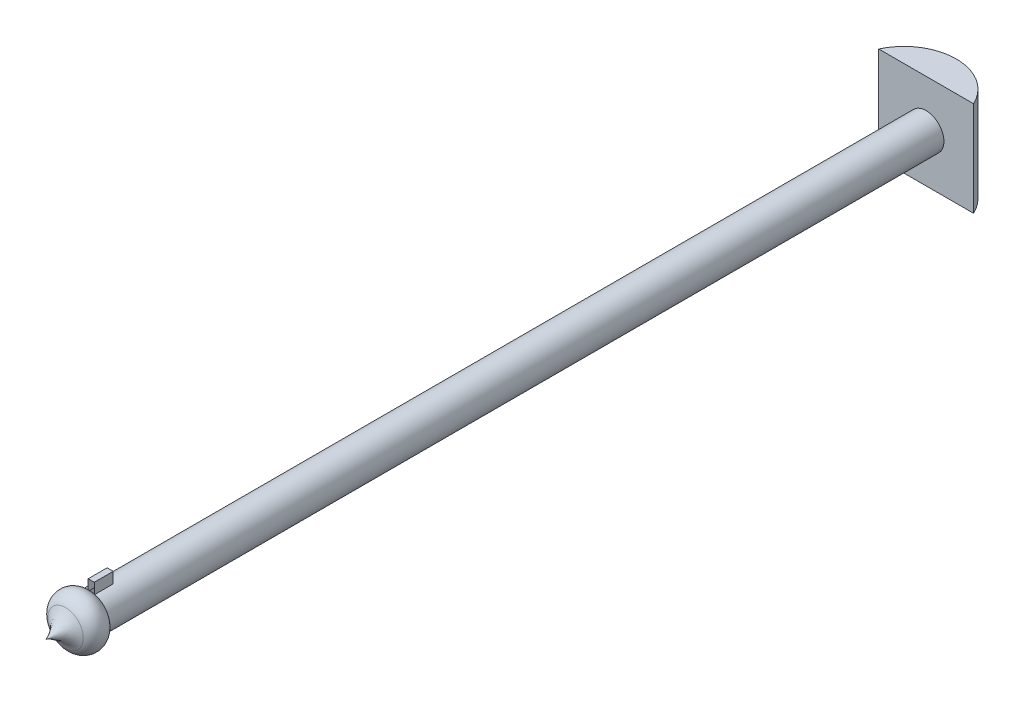
ISO-10303-21;
HEADER;
FILE_DESCRIPTION(('STEP AP214'),'2;1');
FILE_NAME('part.step','',(''),(''),'','','');
FILE_SCHEMA(('AUTOMOTIVE_DESIGN { 1 0 10303 214 1 1 1 1 }'));
ENDSEC;
DATA;
#1=APPLICATION_CONTEXT('core data for automotive mechanical design processes');
#2=APPLICATION_PROTOCOL_DEFINITION('international standard','automotive_design',2000,#1);
#3=PRODUCT_CONTEXT('',#1,'mechanical');
#4=PRODUCT('Part','Part','',(#3));
#5=PRODUCT_RELATED_PRODUCT_CATEGORY('part','',(#4));
#6=PRODUCT_DEFINITION_FORMATION('','',#4);
#7=PRODUCT_DEFINITION_CONTEXT('part definition',#1,'design');
#8=PRODUCT_DEFINITION('design','',#6,#7);
#9=PRODUCT_DEFINITION_SHAPE('','',#8);
#10=(LENGTH_UNIT() NAMED_UNIT(*) SI_UNIT(.MILLI.,.METRE.));
#11=(NAMED_UNIT(*) PLANE_ANGLE_UNIT() SI_UNIT($,.RADIAN.));
#12=(NAMED_UNIT(*) SI_UNIT($,.STERADIAN.) SOLID_ANGLE_UNIT());
#13=UNCERTAINTY_MEASURE_WITH_UNIT(LENGTH_MEASURE(1.E-05),#10,'distance_accuracy_value','');
#14=(GEOMETRIC_REPRESENTATION_CONTEXT(3) GLOBAL_UNCERTAINTY_ASSIGNED_CONTEXT((#13)) GLOBAL_UNIT_ASSIGNED_CONTEXT((#10,
#11,#12)) REPRESENTATION_CONTEXT('',''));
#15=CARTESIAN_POINT('',(0.,0.,0.));
#16=DIRECTION('',(0.,0.,1.));
#17=DIRECTION('',(1.,0.,0.));
#18=AXIS2_PLACEMENT_3D('',#15,#16,#17);
#19=CARTESIAN_POINT('',(0.,6.35,5.53777131074244));
#20=DIRECTION('',(0.,-1.,0.));
#21=DIRECTION('',(0.,0.,-1.));
#22=AXIS2_PLACEMENT_3D('',#19,#20,#21);
#23=CYLINDRICAL_SURFACE('',#22,7.0119607149684);
#24=CARTESIAN_POINT('',(0.,-6.35,5.53777131074244));
#25=DIRECTION('',(0.,1.,0.));
#26=DIRECTION('',(0.,0.,1.));
#27=AXIS2_PLACEMENT_3D('',#24,#25,#26);
#28=CIRCLE('',#27,7.0119607149684);
#29=CARTESIAN_POINT('',(-6.35,-6.35,2.56370119249368));
#30=VERTEX_POINT('',#29);
#31=CARTESIAN_POINT('',(6.35,-6.35,2.56370119249368));
#32=VERTEX_POINT('',#31);
#33=EDGE_CURVE('E147',#30,#32,#28,.F.);
#34=ORIENTED_EDGE('',*,*,#33,.F.);
#35=DIRECTION('',(0.,-1.,0.));
#36=VECTOR('',#35,1.);
#37=CARTESIAN_POINT('',(-6.35,6.35,2.56370119249368));
#38=LINE('',#37,#36);
#39=CARTESIAN_POINT('',(-6.35,6.35,2.56370119249368));
#40=VERTEX_POINT('',#39);
#41=EDGE_CURVE('E166',#40,#30,#38,.T.);
#42=ORIENTED_EDGE('',*,*,#41,.F.);
#43=CARTESIAN_POINT('',(0.,6.35,5.53777131074244));
#44=DIRECTION('',(0.,1.,0.));
#45=DIRECTION('',(0.,0.,1.));
#46=AXIS2_PLACEMENT_3D('',#43,#44,#45);
#47=CIRCLE('',#46,7.0119607149684);
#48=CARTESIAN_POINT('',(6.35,6.35,2.56370119249368));
#49=VERTEX_POINT('',#48);
#50=EDGE_CURVE('E148',#40,#49,#47,.F.);
#51=ORIENTED_EDGE('',*,*,#50,.T.);
#52=DIRECTION('',(0.,-1.,0.));
#53=VECTOR('',#52,1.);
#54=CARTESIAN_POINT('',(6.35,6.35,2.56370119249368));
#55=LINE('',#54,#53);
#56=EDGE_CURVE('E157',#49,#32,#55,.T.);
#57=ORIENTED_EDGE('',*,*,#56,.T.);
#58=EDGE_LOOP('',(#34,#42,#51,#57));
#59=FACE_BOUND('',#58,.T.);
#60=ADVANCED_FACE('F41',(#59),#23,.T.);
#61=CARTESIAN_POINT('',(0.,6.35,2.56370119249368));
#62=DIRECTION('',(0.,0.,1.));
#63=DIRECTION('',(1.,0.,0.));
#64=AXIS2_PLACEMENT_3D('',#61,#62,#63);
#65=PLANE('',#64);
#66=CARTESIAN_POINT('',(0.,0.,2.56370119249368));
#67=DIRECTION('',(0.,0.,1.));
#68=DIRECTION('',(1.,0.,0.));
#69=AXIS2_PLACEMENT_3D('',#66,#67,#68);
#70=CIRCLE('',#69,2.38125);
#71=CARTESIAN_POINT('',(2.38125,0.,2.56370119249368));
#72=VERTEX_POINT('',#71);
#73=EDGE_CURVE('E169',#72,#72,#70,.T.);
#74=ORIENTED_EDGE('',*,*,#73,.F.);
#75=EDGE_LOOP('',(#74));
#76=FACE_BOUND('',#75,.T.);
#77=DIRECTION('',(-1.,0.,0.));
#78=VECTOR('',#77,1.);
#79=CARTESIAN_POINT('',(0.,-6.35,2.56370119249368));
#80=LINE('',#79,#78);
#81=EDGE_CURVE('E153',#32,#30,#80,.T.);
#82=ORIENTED_EDGE('',*,*,#81,.F.);
#83=ORIENTED_EDGE('',*,*,#56,.F.);
#84=DIRECTION('',(-1.,0.,0.));
#85=VECTOR('',#84,1.);
#86=CARTESIAN_POINT('',(0.,6.35,2.56370119249368));
#87=LINE('',#86,#85);
#88=EDGE_CURVE('E152',#49,#40,#87,.T.);
#89=ORIENTED_EDGE('',*,*,#88,.T.);
#90=ORIENTED_EDGE('',*,*,#41,.T.);
#91=EDGE_LOOP('',(#82,#83,#89,#90));
#92=FACE_BOUND('',#91,.T.);
#93=ADVANCED_FACE('F206',(#76,#92),#65,.T.);
#94=CARTESIAN_POINT('',(0.,6.35,0.));
#95=DIRECTION('',(0.,1.,0.));
#96=DIRECTION('',(0.,0.,1.));
#97=AXIS2_PLACEMENT_3D('',#94,#95,#96);
#98=PLANE('',#97);
#99=ORIENTED_EDGE('',*,*,#50,.F.);
#100=ORIENTED_EDGE('',*,*,#88,.F.);
#101=EDGE_LOOP('',(#99,#100));
#102=FACE_BOUND('',#101,.T.);
#103=ADVANCED_FACE('F212',(#102),#98,.T.);
#104=CARTESIAN_POINT('',(0.,-6.35,0.));
#105=DIRECTION('',(0.,1.,0.));
#106=DIRECTION('',(0.,0.,1.));
#107=AXIS2_PLACEMENT_3D('',#104,#105,#106);
#108=PLANE('',#107);
#109=ORIENTED_EDGE('',*,*,#33,.T.);
#110=ORIENTED_EDGE('',*,*,#81,.T.);
#111=EDGE_LOOP('',(#109,#110));
#112=FACE_BOUND('',#111,.T.);
#113=ADVANCED_FACE('F223',(#112),#108,.F.);
#114=CARTESIAN_POINT('',(0.,0.,114.3));
#115=DIRECTION('',(0.,0.,-1.));
#116=DIRECTION('',(-1.,0.,0.));
#117=AXIS2_PLACEMENT_3D('',#114,#115,#116);
#118=CYLINDRICAL_SURFACE('',#117,2.38125);
#119=CARTESIAN_POINT('',(0.,0.,114.3));
#120=DIRECTION('',(0.,0.,1.));
#121=DIRECTION('',(1.,0.,0.));
#122=AXIS2_PLACEMENT_3D('',#119,#120,#121);
#123=CIRCLE('',#122,2.38125);
#124=CARTESIAN_POINT('',(-0.393640410863406,2.34848861811917,114.3));
#125=VERTEX_POINT('',#124);
#126=CARTESIAN_POINT('',(-2.38125,0.,114.3));
#127=VERTEX_POINT('',#126);
#128=EDGE_CURVE('E50',#125,#127,#123,.T.);
#129=ORIENTED_EDGE('',*,*,#128,.F.);
#130=DIRECTION('',(0.,0.,-1.));
#131=VECTOR('',#130,1.);
#132=CARTESIAN_POINT('',(-0.393640410863406,2.34848861811917,114.3));
#133=LINE('',#132,#131);
#134=CARTESIAN_POINT('',(-0.393640410863406,2.34848861811917,111.76));
#135=VERTEX_POINT('',#134);
#136=EDGE_CURVE('E143',#125,#135,#133,.T.);
#137=ORIENTED_EDGE('',*,*,#136,.T.);
#138=CARTESIAN_POINT('',(0.,0.,111.76));
#139=DIRECTION('',(0.,0.,1.));
#140=DIRECTION('',(1.,0.,0.));
#141=AXIS2_PLACEMENT_3D('',#138,#139,#140);
#142=CIRCLE('',#141,2.38125);
#143=CARTESIAN_POINT('',(0.42078802540571,2.34377665321915,111.76));
#144=VERTEX_POINT('',#143);
#145=EDGE_CURVE('E11',#144,#135,#142,.T.);
#146=ORIENTED_EDGE('',*,*,#145,.F.);
#147=DIRECTION('',(0.,0.,-1.));
#148=VECTOR('',#147,1.);
#149=CARTESIAN_POINT('',(0.420788025405711,2.34377665321915,114.3));
#150=LINE('',#149,#148);
#151=CARTESIAN_POINT('',(0.420788025405711,2.34377665321915,114.3));
#152=VERTEX_POINT('',#151);
#153=EDGE_CURVE('E136',#144,#152,#150,.F.);
#154=ORIENTED_EDGE('',*,*,#153,.T.);
#155=EDGE_CURVE('E171',#127,#152,#123,.T.);
#156=ORIENTED_EDGE('',*,*,#155,.F.);
#157=EDGE_LOOP('',(#129,#137,#146,#154,#156));
#158=FACE_BOUND('',#157,.T.);
#159=ORIENTED_EDGE('',*,*,#73,.T.);
#160=EDGE_LOOP('',(#159));
#161=FACE_BOUND('',#160,.T.);
#162=ADVANCED_FACE('F43',(#158,#161),#118,.T.);
#163=CARTESIAN_POINT('',(0.,0.,114.3));
#164=DIRECTION('',(0.,0.,1.));
#165=DIRECTION('',(1.,0.,0.));
#166=AXIS2_PLACEMENT_3D('',#163,#164,#165);
#167=PLANE('',#166);
#168=ORIENTED_EDGE('',*,*,#128,.T.);
#169=CARTESIAN_POINT('',(-2.13477296963881E-05,0.,114.3));
#170=DIRECTION('',(0.,0.,-1.));
#171=DIRECTION('',(-1.,0.,0.));
#172=AXIS2_PLACEMENT_3D('',#169,#170,#171);
#173=CIRCLE('',#172,2.3812286522703);
#174=EDGE_CURVE('E55',#127,#127,#173,.T.);
#175=ORIENTED_EDGE('',*,*,#174,.T.);
#176=ORIENTED_EDGE('',*,*,#155,.T.);
#177=DIRECTION('',(0.,1.,0.));
#178=VECTOR('',#177,1.);
#179=CARTESIAN_POINT('',(0.420788025405711,0.,114.3));
#180=LINE('',#179,#178);
#181=CARTESIAN_POINT('',(0.420788025405711,3.80066603592294,114.3));
#182=VERTEX_POINT('',#181);
#183=EDGE_CURVE('E109',#152,#182,#180,.T.);
#184=ORIENTED_EDGE('',*,*,#183,.T.);
#185=DIRECTION('',(-1.,0.,0.));
#186=VECTOR('',#185,1.);
#187=CARTESIAN_POINT('',(0.420788025405711,3.80066603592294,114.3));
#188=LINE('',#187,#186);
#189=CARTESIAN_POINT('',(-0.393640410863406,3.80066603592294,114.3));
#190=VERTEX_POINT('',#189);
#191=EDGE_CURVE('E113',#182,#190,#188,.T.);
#192=ORIENTED_EDGE('',*,*,#191,.T.);
#193=DIRECTION('',(0.,-1.,0.));
#194=VECTOR('',#193,1.);
#195=CARTESIAN_POINT('',(-0.393640410863406,3.80066603592294,114.3));
#196=LINE('',#195,#194);
#197=EDGE_CURVE('E62',#190,#125,#196,.T.);
#198=ORIENTED_EDGE('',*,*,#197,.T.);
#199=EDGE_LOOP('',(#168,#175,#176,#184,#192,#198));
#200=FACE_BOUND('',#199,.T.);
#201=ADVANCED_FACE('F179',(#200),#167,.T.);
#202=CARTESIAN_POINT('',(-0.393640410863406,3.80066603592294,111.76));
#203=DIRECTION('',(-1.,0.,0.));
#204=DIRECTION('',(0.,0.,1.));
#205=AXIS2_PLACEMENT_3D('',#202,#203,#204);
#206=PLANE('',#205);
#207=ORIENTED_EDGE('',*,*,#136,.F.);
#208=ORIENTED_EDGE('',*,*,#197,.F.);
#209=DIRECTION('',(0.,0.,1.));
#210=VECTOR('',#209,1.);
#211=CARTESIAN_POINT('',(-0.393640410863406,3.80066603592294,111.76));
#212=LINE('',#211,#210);
#213=CARTESIAN_POINT('',(-0.393640410863406,3.80066603592294,111.76));
#214=VERTEX_POINT('',#213);
#215=EDGE_CURVE('E133',#214,#190,#212,.T.);
#216=ORIENTED_EDGE('',*,*,#215,.F.);
#217=DIRECTION('',(0.,-1.,0.));
#218=VECTOR('',#217,1.);
#219=CARTESIAN_POINT('',(-0.393640410863406,3.80066603592294,111.76));
#220=LINE('',#219,#218);
#221=EDGE_CURVE('E124',#214,#135,#220,.T.);
#222=ORIENTED_EDGE('',*,*,#221,.T.);
#223=EDGE_LOOP('',(#207,#208,#216,#222));
#224=FACE_BOUND('',#223,.T.);
#225=ADVANCED_FACE('F193',(#224),#206,.T.);
#226=CARTESIAN_POINT('',(0.420788025405711,0.,111.76));
#227=DIRECTION('',(1.,0.,0.));
#228=DIRECTION('',(0.,0.,-1.));
#229=AXIS2_PLACEMENT_3D('',#226,#227,#228);
#230=PLANE('',#229);
#231=ORIENTED_EDGE('',*,*,#153,.F.);
#232=DIRECTION('',(0.,1.,0.));
#233=VECTOR('',#232,1.);
#234=CARTESIAN_POINT('',(0.420788025405711,0.,111.76));
#235=LINE('',#234,#233);
#236=CARTESIAN_POINT('',(0.420788025405711,3.80066603592294,111.76));
#237=VERTEX_POINT('',#236);
#238=EDGE_CURVE('E117',#144,#237,#235,.T.);
#239=ORIENTED_EDGE('',*,*,#238,.T.);
#240=DIRECTION('',(0.,0.,1.));
#241=VECTOR('',#240,1.);
#242=CARTESIAN_POINT('',(0.420788025405711,3.80066603592294,111.76));
#243=LINE('',#242,#241);
#244=EDGE_CURVE('E127',#237,#182,#243,.T.);
#245=ORIENTED_EDGE('',*,*,#244,.T.);
#246=ORIENTED_EDGE('',*,*,#183,.F.);
#247=EDGE_LOOP('',(#231,#239,#245,#246));
#248=FACE_BOUND('',#247,.T.);
#249=ADVANCED_FACE('F183',(#248),#230,.T.);
#250=CARTESIAN_POINT('',(0.420788025405711,3.80066603592294,111.76));
#251=DIRECTION('',(0.,1.,0.));
#252=DIRECTION('',(0.,0.,1.));
#253=AXIS2_PLACEMENT_3D('',#250,#251,#252);
#254=PLANE('',#253);
#255=ORIENTED_EDGE('',*,*,#191,.F.);
#256=ORIENTED_EDGE('',*,*,#244,.F.);
#257=DIRECTION('',(-1.,0.,0.));
#258=VECTOR('',#257,1.);
#259=CARTESIAN_POINT('',(0.420788025405711,3.80066603592294,111.76));
#260=LINE('',#259,#258);
#261=EDGE_CURVE('E120',#237,#214,#260,.T.);
#262=ORIENTED_EDGE('',*,*,#261,.T.);
#263=ORIENTED_EDGE('',*,*,#215,.T.);
#264=EDGE_LOOP('',(#255,#256,#262,#263));
#265=FACE_BOUND('',#264,.T.);
#266=ADVANCED_FACE('F195',(#265),#254,.T.);
#267=CARTESIAN_POINT('',(0.,0.,111.76));
#268=DIRECTION('',(0.,0.,1.));
#269=DIRECTION('',(1.,0.,0.));
#270=AXIS2_PLACEMENT_3D('',#267,#268,#269);
#271=PLANE('',#270);
#272=ORIENTED_EDGE('',*,*,#238,.F.);
#273=ORIENTED_EDGE('',*,*,#145,.T.);
#274=ORIENTED_EDGE('',*,*,#221,.F.);
#275=ORIENTED_EDGE('',*,*,#261,.F.);
#276=EDGE_LOOP('',(#272,#273,#274,#275));
#277=FACE_BOUND('',#276,.T.);
#278=ADVANCED_FACE('F190',(#277),#271,.F.);
#279=CARTESIAN_POINT('',(-2.13477296963881E-05,0.,116.008468849778));
#280=DIRECTION('',(0.,0.,-1.));
#281=DIRECTION('',(-1.,0.,0.));
#282=AXIS2_PLACEMENT_3D('',#279,#280,#281);
#283=DEGENERATE_TOROIDAL_SURFACE('',#282,1.55504909457605,1.89774562895348,.T.);
#284=CARTESIAN_POINT('',(-2.13477296963881E-05,0.,117.721941476185));
#285=DIRECTION('',(0.,0.,-1.));
#286=DIRECTION('',(-1.,0.,0.));
#287=AXIS2_PLACEMENT_3D('',#284,#285,#286);
#288=CIRCLE('',#287,2.37080030098921);
#289=CARTESIAN_POINT('',(-2.37082164871891,0.,117.721941476185));
#290=VERTEX_POINT('',#289);
#291=EDGE_CURVE('E106',#290,#290,#288,.T.);
#292=ORIENTED_EDGE('',*,*,#291,.T.);
#293=EDGE_LOOP('',(#292));
#294=FACE_BOUND('',#293,.T.);
#295=ORIENTED_EDGE('',*,*,#174,.F.);
#296=EDGE_LOOP('',(#295));
#297=FACE_BOUND('',#296,.T.);
#298=ADVANCED_FACE('F102',(#294,#297),#283,.T.);
#299=CARTESIAN_POINT('',(-4.36576896415338,0.,121.912297051817));
#300=DIRECTION('',(0.,-1.,0.));
#301=DIRECTION('',(-1.,0.,0.));
#302=AXIS2_PLACEMENT_3D('',#299,#300,#301);
#303=CIRCLE('',#302,4.64100146968181);
#304=TRIMMED_CURVE('',#303,(PARAMETER_VALUE(-2.79545723060174)),
(PARAMETER_VALUE(2.79545723060174)),.T.,.PARAMETER.);
#305=CARTESIAN_POINT('',(-2.13477296968217E-05,0.,121.912297051817));
#306=DIRECTION('',(0.,0.,-1.));
#307=AXIS1_PLACEMENT('',#305,#306);
#308=SURFACE_OF_REVOLUTION('',#304,#307);
#309=CARTESIAN_POINT('',(-2.13477296963881E-05,0.,120.3377677916));
#310=VERTEX_POINT('',#309);
#311=VERTEX_LOOP('',#310);
#312=FACE_BOUND('',#311,.T.);
#313=ORIENTED_EDGE('',*,*,#291,.F.);
#314=EDGE_LOOP('',(#313));
#315=FACE_BOUND('',#314,.T.);
#316=ADVANCED_FACE('F99',(#312,#315),#308,.F.);
#317=CLOSED_SHELL('',(#60,#93,#103,#113,#162,#201,#225,#249,#266,#278,#298,#316));
#318=MANIFOLD_SOLID_BREP('B2',#317);
#319=ADVANCED_BREP_SHAPE_REPRESENTATION('',(#18,#318),#14);
#320=SHAPE_DEFINITION_REPRESENTATION(#9,#319);
ENDSEC;
END-ISO-10303-21;
